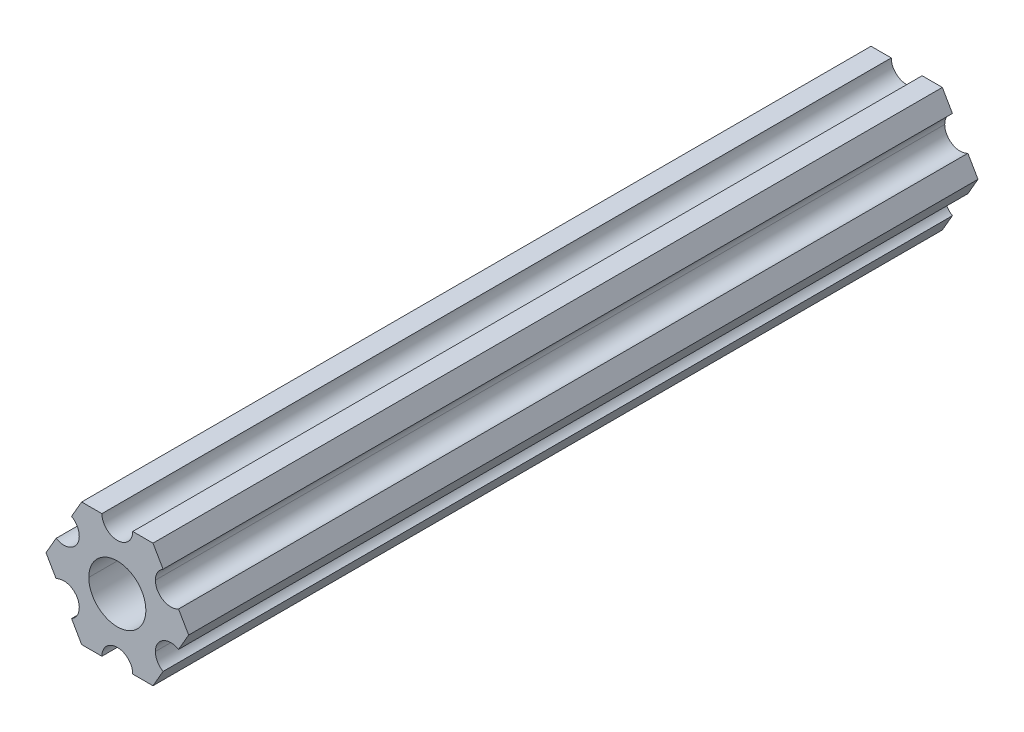
ISO-10303-21;
HEADER;
FILE_DESCRIPTION(('STEP AP214'),'2;1');
FILE_NAME('part.step','',(''),(''),'','','');
FILE_SCHEMA(('AUTOMOTIVE_DESIGN { 1 0 10303 214 1 1 1 1 }'));
ENDSEC;
DATA;
#1=APPLICATION_CONTEXT('core data for automotive mechanical design processes');
#2=APPLICATION_PROTOCOL_DEFINITION('international standard','automotive_design',2000,#1);
#3=PRODUCT_CONTEXT('',#1,'mechanical');
#4=PRODUCT('Part','Part','',(#3));
#5=PRODUCT_RELATED_PRODUCT_CATEGORY('part','',(#4));
#6=PRODUCT_DEFINITION_FORMATION('','',#4);
#7=PRODUCT_DEFINITION_CONTEXT('part definition',#1,'design');
#8=PRODUCT_DEFINITION('design','',#6,#7);
#9=PRODUCT_DEFINITION_SHAPE('','',#8);
#10=(LENGTH_UNIT() NAMED_UNIT(*) SI_UNIT(.MILLI.,.METRE.));
#11=(NAMED_UNIT(*) PLANE_ANGLE_UNIT() SI_UNIT($,.RADIAN.));
#12=(NAMED_UNIT(*) SI_UNIT($,.STERADIAN.) SOLID_ANGLE_UNIT());
#13=UNCERTAINTY_MEASURE_WITH_UNIT(LENGTH_MEASURE(1.E-05),#10,'distance_accuracy_value','');
#14=(GEOMETRIC_REPRESENTATION_CONTEXT(3) GLOBAL_UNCERTAINTY_ASSIGNED_CONTEXT((#13)) GLOBAL_UNIT_ASSIGNED_CONTEXT((#10,
#11,#12)) REPRESENTATION_CONTEXT('',''));
#15=CARTESIAN_POINT('',(0.,0.,0.));
#16=DIRECTION('',(0.,0.,1.));
#17=DIRECTION('',(1.,0.,0.));
#18=AXIS2_PLACEMENT_3D('',#15,#16,#17);
#19=CARTESIAN_POINT('',(0.,0.,304.8));
#20=DIRECTION('',(0.,0.,-1.));
#21=DIRECTION('',(-1.,0.,0.));
#22=AXIS2_PLACEMENT_3D('',#19,#20,#21);
#23=CYLINDRICAL_SURFACE('',#22,2.9337);
#24=CARTESIAN_POINT('',(0.,0.,81.153));
#25=DIRECTION('',(0.,0.,1.));
#26=DIRECTION('',(1.,0.,0.));
#27=AXIS2_PLACEMENT_3D('',#24,#25,#26);
#28=CIRCLE('',#27,2.9337);
#29=CARTESIAN_POINT('',(2.9337,0.,81.153));
#30=VERTEX_POINT('',#29);
#31=CARTESIAN_POINT('',(-2.9337,0.,81.153));
#32=VERTEX_POINT('',#31);
#33=EDGE_CURVE('E72',#30,#32,#28,.F.);
#34=ORIENTED_EDGE('',*,*,#33,.F.);
#35=DIRECTION('',(0.,0.,-1.));
#36=VECTOR('',#35,1.);
#37=CARTESIAN_POINT('',(2.9337,0.,304.8));
#38=LINE('',#37,#36);
#39=CARTESIAN_POINT('',(2.9337,0.,0.));
#40=VERTEX_POINT('',#39);
#41=EDGE_CURVE('E59',#30,#40,#38,.T.);
#42=ORIENTED_EDGE('',*,*,#41,.T.);
#43=CARTESIAN_POINT('',(0.,0.,0.));
#44=DIRECTION('',(0.,0.,1.));
#45=DIRECTION('',(1.,0.,0.));
#46=AXIS2_PLACEMENT_3D('',#43,#44,#45);
#47=CIRCLE('',#46,2.9337);
#48=CARTESIAN_POINT('',(-2.9337,0.,0.));
#49=VERTEX_POINT('',#48);
#50=EDGE_CURVE('E275',#49,#40,#47,.T.);
#51=ORIENTED_EDGE('',*,*,#50,.F.);
#52=DIRECTION('',(0.,0.,-1.));
#53=VECTOR('',#52,1.);
#54=CARTESIAN_POINT('',(-2.9337,0.,304.8));
#55=LINE('',#54,#53);
#56=EDGE_CURVE('E325',#32,#49,#55,.T.);
#57=ORIENTED_EDGE('',*,*,#56,.F.);
#58=EDGE_LOOP('',(#34,#42,#51,#57));
#59=FACE_BOUND('',#58,.T.);
#60=ADVANCED_FACE('F50',(#59),#23,.F.);
#61=CARTESIAN_POINT('',(5.49926150638082,-3.17499966684067,304.8));
#62=DIRECTION('',(0.,0.,-1.));
#63=DIRECTION('',(-1.,0.,0.));
#64=AXIS2_PLACEMENT_3D('',#61,#62,#63);
#65=CYLINDRICAL_SURFACE('',#64,1.5875);
#66=CARTESIAN_POINT('',(5.49926150638082,-3.17499966684067,81.153));
#67=DIRECTION('',(0.,0.,1.));
#68=DIRECTION('',(1.,0.,0.));
#69=AXIS2_PLACEMENT_3D('',#66,#67,#68);
#70=CIRCLE('',#69,1.5875);
#71=CARTESIAN_POINT('',(3.91176150638082,-3.17499966684067,81.153));
#72=VERTEX_POINT('',#71);
#73=CARTESIAN_POINT('',(6.29301142309097,-1.80018429024546,81.153));
#74=VERTEX_POINT('',#73);
#75=EDGE_CURVE('E225',#72,#74,#70,.F.);
#76=ORIENTED_EDGE('',*,*,#75,.F.);
#77=DIRECTION('',(0.,0.,-1.));
#78=VECTOR('',#77,1.);
#79=CARTESIAN_POINT('',(3.91176150638082,-3.17499966684067,304.8));
#80=LINE('',#79,#78);
#81=CARTESIAN_POINT('',(3.91176150638082,-3.17499966684067,0.));
#82=VERTEX_POINT('',#81);
#83=EDGE_CURVE('E264',#72,#82,#80,.T.);
#84=ORIENTED_EDGE('',*,*,#83,.T.);
#85=CARTESIAN_POINT('',(5.49926150638082,-3.17499966684067,0.));
#86=DIRECTION('',(0.,0.,-1.));
#87=DIRECTION('',(1.,0.,0.));
#88=AXIS2_PLACEMENT_3D('',#85,#86,#87);
#89=CIRCLE('',#88,1.5875);
#90=CARTESIAN_POINT('',(6.29301142309098,-1.80018429024546,0.));
#91=VERTEX_POINT('',#90);
#92=EDGE_CURVE('E267',#82,#91,#89,.T.);
#93=ORIENTED_EDGE('',*,*,#92,.T.);
#94=DIRECTION('',(0.,0.,-1.));
#95=VECTOR('',#94,1.);
#96=CARTESIAN_POINT('',(6.29301142309098,-1.80018429024546,304.8));
#97=LINE('',#96,#95);
#98=EDGE_CURVE('E251',#74,#91,#97,.T.);
#99=ORIENTED_EDGE('',*,*,#98,.F.);
#100=EDGE_LOOP('',(#76,#84,#93,#99));
#101=FACE_BOUND('',#100,.T.);
#102=ADVANCED_FACE('F359',(#101),#65,.F.);
#103=CARTESIAN_POINT('',(5.49926112168156,3.17500033315934,304.8));
#104=DIRECTION('',(0.,0.,-1.));
#105=DIRECTION('',(-1.,0.,0.));
#106=AXIS2_PLACEMENT_3D('',#103,#104,#105);
#107=CYLINDRICAL_SURFACE('',#106,1.5875);
#108=CARTESIAN_POINT('',(5.49926112168156,3.17500033315934,81.153));
#109=DIRECTION('',(0.,0.,1.));
#110=DIRECTION('',(1.,0.,0.));
#111=AXIS2_PLACEMENT_3D('',#108,#109,#110);
#112=CIRCLE('',#111,1.5875);
#113=CARTESIAN_POINT('',(3.91176112168156,3.17500033315934,81.153));
#114=VERTEX_POINT('',#113);
#115=CARTESIAN_POINT('',(4.70551103839171,4.54981561357971,81.153));
#116=VERTEX_POINT('',#115);
#117=EDGE_CURVE('E374',#114,#116,#112,.F.);
#118=ORIENTED_EDGE('',*,*,#117,.F.);
#119=DIRECTION('',(0.,0.,-1.));
#120=VECTOR('',#119,1.);
#121=CARTESIAN_POINT('',(3.91176112168156,3.17500033315934,304.8));
#122=LINE('',#121,#120);
#123=CARTESIAN_POINT('',(3.91176112168156,3.17500033315934,0.));
#124=VERTEX_POINT('',#123);
#125=EDGE_CURVE('E316',#114,#124,#122,.T.);
#126=ORIENTED_EDGE('',*,*,#125,.T.);
#127=CARTESIAN_POINT('',(5.49926112168156,3.17500033315934,0.));
#128=DIRECTION('',(0.,0.,-1.));
#129=DIRECTION('',(1.,0.,0.));
#130=AXIS2_PLACEMENT_3D('',#127,#128,#129);
#131=CIRCLE('',#130,1.5875);
#132=CARTESIAN_POINT('',(4.70551103839172,4.54981561357972,0.));
#133=VERTEX_POINT('',#132);
#134=EDGE_CURVE('E312',#124,#133,#131,.T.);
#135=ORIENTED_EDGE('',*,*,#134,.T.);
#136=DIRECTION('',(0.,0.,-1.));
#137=VECTOR('',#136,1.);
#138=CARTESIAN_POINT('',(4.70551103839172,4.54981561357972,304.8));
#139=LINE('',#138,#137);
#140=EDGE_CURVE('E263',#116,#133,#139,.T.);
#141=ORIENTED_EDGE('',*,*,#140,.F.);
#142=EDGE_LOOP('',(#118,#126,#135,#141));
#143=FACE_BOUND('',#142,.T.);
#144=ADVANCED_FACE('F691',(#143),#107,.F.);
#145=CARTESIAN_POINT('',(6.29301142309098,-1.80018429024546,304.8));
#146=DIRECTION('',(-0.866025434075723,0.499999947533953,0.));
#147=DIRECTION('',(0.,0.,1.));
#148=AXIS2_PLACEMENT_3D('',#145,#146,#147);
#149=PLANE('',#148);
#150=DIRECTION('',(0.499999947533948,0.866025434075726,0.));
#151=VECTOR('',#150,1.);
#152=CARTESIAN_POINT('',(3.66617459405349,-6.34999977789373,81.153));
#153=LINE('',#152,#151);
#154=CARTESIAN_POINT('',(7.33234841870826,4.44212561699631E-07,81.153));
#155=VERTEX_POINT('',#154);
#156=EDGE_CURVE('E219',#74,#155,#153,.T.);
#157=ORIENTED_EDGE('',*,*,#156,.F.);
#158=ORIENTED_EDGE('',*,*,#98,.T.);
#159=DIRECTION('',(0.499999947533953,0.866025434075723,0.));
#160=VECTOR('',#159,1.);
#161=CARTESIAN_POINT('',(6.29301142309098,-1.80018429024546,0.));
#162=LINE('',#161,#160);
#163=CARTESIAN_POINT('',(7.33234841870827,4.44212519169686E-07,0.));
#164=VERTEX_POINT('',#163);
#165=EDGE_CURVE('E244',#91,#164,#162,.T.);
#166=ORIENTED_EDGE('',*,*,#165,.T.);
#167=DIRECTION('',(0.,0.,-1.));
#168=VECTOR('',#167,1.);
#169=CARTESIAN_POINT('',(7.33234841870827,4.44212519169686E-07,304.8));
#170=LINE('',#169,#168);
#171=EDGE_CURVE('E234',#155,#164,#170,.T.);
#172=ORIENTED_EDGE('',*,*,#171,.F.);
#173=EDGE_LOOP('',(#157,#158,#166,#172));
#174=FACE_BOUND('',#173,.T.);
#175=ADVANCED_FACE('F242',(#174),#149,.F.);
#176=CARTESIAN_POINT('',(7.33234841870827,4.44212519169686E-07,304.8));
#177=DIRECTION('',(-0.866025373493145,-0.500000052466057,0.));
#178=DIRECTION('',(-0.500000052466057,0.866025373493145,0.));
#179=AXIS2_PLACEMENT_3D('',#176,#177,#178);
#180=PLANE('',#179);
#181=DIRECTION('',(-0.50000005246605,0.866025373493149,0.));
#182=VECTOR('',#181,1.);
#183=CARTESIAN_POINT('',(7.33234841870826,4.44212561699631E-07,81.153));
#184=LINE('',#183,#182);
#185=CARTESIAN_POINT('',(6.29301120497142,1.80018505273897,81.153));
#186=VERTEX_POINT('',#185);
#187=EDGE_CURVE('E222',#155,#186,#184,.T.);
#188=ORIENTED_EDGE('',*,*,#187,.F.);
#189=ORIENTED_EDGE('',*,*,#171,.T.);
#190=DIRECTION('',(-0.500000052466056,0.866025373493145,0.));
#191=VECTOR('',#190,1.);
#192=CARTESIAN_POINT('',(7.33234841870827,4.44212519169686E-07,0.));
#193=LINE('',#192,#191);
#194=CARTESIAN_POINT('',(6.29301120497139,1.80018505273894,0.));
#195=VERTEX_POINT('',#194);
#196=EDGE_CURVE('E246',#164,#195,#193,.T.);
#197=ORIENTED_EDGE('',*,*,#196,.T.);
#198=DIRECTION('',(0.,0.,-1.));
#199=VECTOR('',#198,1.);
#200=CARTESIAN_POINT('',(6.29301120497139,1.80018505273894,304.8));
#201=LINE('',#200,#199);
#202=EDGE_CURVE('E236',#186,#195,#201,.T.);
#203=ORIENTED_EDGE('',*,*,#202,.F.);
#204=EDGE_LOOP('',(#188,#189,#197,#203));
#205=FACE_BOUND('',#204,.T.);
#206=ADVANCED_FACE('F52',(#205),#180,.F.);
#207=CARTESIAN_POINT('',(5.49926112168156,3.17500033315934,304.8));
#208=DIRECTION('',(0.,0.,-1.));
#209=DIRECTION('',(-1.,0.,0.));
#210=AXIS2_PLACEMENT_3D('',#207,#208,#209);
#211=CYLINDRICAL_SURFACE('',#210,1.5875);
#212=CARTESIAN_POINT('',(5.49926112168156,3.17500033315934,81.153));
#213=DIRECTION('',(0.,0.,1.));
#214=DIRECTION('',(1.,0.,0.));
#215=AXIS2_PLACEMENT_3D('',#212,#213,#214);
#216=CIRCLE('',#215,1.5875);
#217=EDGE_CURVE('E371',#186,#114,#216,.F.);
#218=ORIENTED_EDGE('',*,*,#217,.F.);
#219=ORIENTED_EDGE('',*,*,#202,.T.);
#220=CARTESIAN_POINT('',(5.49926112168156,3.17500033315934,0.));
#221=DIRECTION('',(0.,0.,-1.));
#222=DIRECTION('',(1.,0.,0.));
#223=AXIS2_PLACEMENT_3D('',#220,#221,#222);
#224=CIRCLE('',#223,1.5875);
#225=EDGE_CURVE('E253',#195,#124,#224,.T.);
#226=ORIENTED_EDGE('',*,*,#225,.T.);
#227=ORIENTED_EDGE('',*,*,#125,.F.);
#228=EDGE_LOOP('',(#218,#219,#226,#227));
#229=FACE_BOUND('',#228,.T.);
#230=ADVANCED_FACE('F370',(#229),#211,.F.);
#231=CARTESIAN_POINT('',(4.70551103839172,4.54981561357972,304.8));
#232=DIRECTION('',(-0.866025373493151,-0.500000052466046,0.));
#233=DIRECTION('',(-0.500000052466046,0.866025373493151,0.));
#234=AXIS2_PLACEMENT_3D('',#231,#232,#233);
#235=PLANE('',#234);
#236=CARTESIAN_POINT('',(3.66617382465477,6.3500002221063,81.153));
#237=VERTEX_POINT('',#236);
#238=EDGE_CURVE('E239',#116,#237,#184,.T.);
#239=ORIENTED_EDGE('',*,*,#238,.F.);
#240=ORIENTED_EDGE('',*,*,#140,.T.);
#241=DIRECTION('',(-0.500000052466046,0.866025373493151,0.));
#242=VECTOR('',#241,1.);
#243=CARTESIAN_POINT('',(4.70551103839172,4.54981561357972,0.));
#244=LINE('',#243,#242);
#245=CARTESIAN_POINT('',(3.66617382465481,6.35000022210627,0.));
#246=VERTEX_POINT('',#245);
#247=EDGE_CURVE('E259',#133,#246,#244,.T.);
#248=ORIENTED_EDGE('',*,*,#247,.T.);
#249=DIRECTION('',(0.,0.,-1.));
#250=VECTOR('',#249,1.);
#251=CARTESIAN_POINT('',(3.66617382465481,6.35000022210627,304.8));
#252=LINE('',#251,#250);
#253=EDGE_CURVE('E335',#237,#246,#252,.T.);
#254=ORIENTED_EDGE('',*,*,#253,.F.);
#255=EDGE_LOOP('',(#239,#240,#248,#254));
#256=FACE_BOUND('',#255,.T.);
#257=ADVANCED_FACE('F639',(#256),#235,.F.);
#258=CARTESIAN_POINT('',(3.66617382465481,6.35000022210627,304.8));
#259=DIRECTION('',(6.05825850611185E-08,-1.,0.));
#260=DIRECTION('',(0.,0.,-1.));
#261=AXIS2_PLACEMENT_3D('',#258,#259,#260);
#262=PLANE('',#261);
#263=DIRECTION('',(-0.999999999999998,-6.05825767497455E-08,0.));
#264=VECTOR('',#263,1.);
#265=CARTESIAN_POINT('',(3.66617382465477,6.3500002221063,81.153));
#266=LINE('',#265,#264);
#267=CARTESIAN_POINT('',(1.58749961530074,6.35000009617486,81.153));
#268=VERTEX_POINT('',#267);
#269=EDGE_CURVE('E1010',#237,#268,#266,.T.);
#270=ORIENTED_EDGE('',*,*,#269,.F.);
#271=ORIENTED_EDGE('',*,*,#253,.T.);
#272=DIRECTION('',(-1.,-6.05825850611185E-08,0.));
#273=VECTOR('',#272,1.);
#274=CARTESIAN_POINT('',(3.66617382465481,6.35000022210627,0.));
#275=LINE('',#274,#273);
#276=CARTESIAN_POINT('',(1.58749961530074,6.35000009617482,0.));
#277=VERTEX_POINT('',#276);
#278=EDGE_CURVE('E338',#246,#277,#275,.T.);
#279=ORIENTED_EDGE('',*,*,#278,.T.);
#280=DIRECTION('',(0.,0.,-1.));
#281=VECTOR('',#280,1.);
#282=CARTESIAN_POINT('',(1.58749961530074,6.35000009617482,304.8));
#283=LINE('',#282,#281);
#284=EDGE_CURVE('E288',#268,#277,#283,.T.);
#285=ORIENTED_EDGE('',*,*,#284,.F.);
#286=EDGE_LOOP('',(#270,#271,#279,#285));
#287=FACE_BOUND('',#286,.T.);
#288=ADVANCED_FACE('F625',(#287),#262,.F.);
#289=CARTESIAN_POINT('',(-3.84699260060323E-07,6.35,304.8));
#290=DIRECTION('',(0.,0.,-1.));
#291=DIRECTION('',(-1.,0.,0.));
#292=AXIS2_PLACEMENT_3D('',#289,#290,#291);
#293=CYLINDRICAL_SURFACE('',#292,1.5875);
#294=CARTESIAN_POINT('',(-3.84699260060323E-07,6.35,81.153));
#295=DIRECTION('',(0.,0.,1.));
#296=DIRECTION('',(1.,0.,0.));
#297=AXIS2_PLACEMENT_3D('',#294,#295,#296);
#298=CIRCLE('',#297,1.5875);
#299=CARTESIAN_POINT('',(-1.58750038469926,6.34999990382518,81.153));
#300=VERTEX_POINT('',#299);
#301=EDGE_CURVE('E375',#268,#300,#298,.F.);
#302=ORIENTED_EDGE('',*,*,#301,.F.);
#303=ORIENTED_EDGE('',*,*,#284,.T.);
#304=CARTESIAN_POINT('',(-3.84699260060323E-07,6.35,0.));
#305=DIRECTION('',(0.,0.,-1.));
#306=DIRECTION('',(1.,0.,0.));
#307=AXIS2_PLACEMENT_3D('',#304,#305,#306);
#308=CIRCLE('',#307,1.5875);
#309=CARTESIAN_POINT('',(-1.58750038469926,6.34999990382519,0.));
#310=VERTEX_POINT('',#309);
#311=EDGE_CURVE('E339',#277,#310,#308,.T.);
#312=ORIENTED_EDGE('',*,*,#311,.T.);
#313=DIRECTION('',(0.,0.,-1.));
#314=VECTOR('',#313,1.);
#315=CARTESIAN_POINT('',(-1.58750038469926,6.34999990382519,304.8));
#316=LINE('',#315,#314);
#317=EDGE_CURVE('E280',#300,#310,#316,.T.);
#318=ORIENTED_EDGE('',*,*,#317,.F.);
#319=EDGE_LOOP('',(#302,#303,#312,#318));
#320=FACE_BOUND('',#319,.T.);
#321=ADVANCED_FACE('F611',(#320),#293,.F.);
#322=CARTESIAN_POINT('',(-1.58750038469926,6.34999990382518,304.8));
#323=DIRECTION('',(6.05825963273174E-08,-1.,0.));
#324=DIRECTION('',(0.,0.,-1.));
#325=AXIS2_PLACEMENT_3D('',#322,#323,#324);
#326=PLANE('',#325);
#327=CARTESIAN_POINT('',(-3.66617459405349,6.34999977789374,81.153));
#328=VERTEX_POINT('',#327);
#329=EDGE_CURVE('E238',#300,#328,#266,.T.);
#330=ORIENTED_EDGE('',*,*,#329,.F.);
#331=ORIENTED_EDGE('',*,*,#317,.T.);
#332=DIRECTION('',(-1.,-6.05825963273174E-08,0.));
#333=VECTOR('',#332,1.);
#334=CARTESIAN_POINT('',(-1.58750038469926,6.34999990382518,0.));
#335=LINE('',#334,#333);
#336=CARTESIAN_POINT('',(-3.66617459405349,6.3499997778937,0.));
#337=VERTEX_POINT('',#336);
#338=EDGE_CURVE('E283',#310,#337,#335,.T.);
#339=ORIENTED_EDGE('',*,*,#338,.T.);
#340=DIRECTION('',(0.,0.,-1.));
#341=VECTOR('',#340,1.);
#342=CARTESIAN_POINT('',(-3.66617459405349,6.3499997778937,304.8));
#343=LINE('',#342,#341);
#344=EDGE_CURVE('E289',#328,#337,#343,.T.);
#345=ORIENTED_EDGE('',*,*,#344,.F.);
#346=EDGE_LOOP('',(#330,#331,#339,#345));
#347=FACE_BOUND('',#346,.T.);
#348=ADVANCED_FACE('F597',(#347),#326,.F.);
#349=CARTESIAN_POINT('',(-3.66617459405349,6.3499997778937,304.8));
#350=DIRECTION('',(0.866025434075729,-0.499999947533942,0.));
#351=DIRECTION('',(0.,0.,-1.));
#352=AXIS2_PLACEMENT_3D('',#349,#350,#351);
#353=PLANE('',#352);
#354=DIRECTION('',(-0.499999947533949,-0.866025434075725,0.));
#355=VECTOR('',#354,1.);
#356=CARTESIAN_POINT('',(-3.66617459405349,6.34999977789374,81.153));
#357=LINE('',#356,#355);
#358=CARTESIAN_POINT('',(-4.70551158967069,4.54981504343589,81.153));
#359=VERTEX_POINT('',#358);
#360=EDGE_CURVE('E1004',#328,#359,#357,.T.);
#361=ORIENTED_EDGE('',*,*,#360,.F.);
#362=ORIENTED_EDGE('',*,*,#344,.T.);
#363=DIRECTION('',(-0.499999947533943,-0.866025434075729,0.));
#364=VECTOR('',#363,1.);
#365=CARTESIAN_POINT('',(-3.66617459405349,6.3499997778937,0.));
#366=LINE('',#365,#364);
#367=CARTESIAN_POINT('',(-4.70551158967065,4.54981504343587,0.));
#368=VERTEX_POINT('',#367);
#369=EDGE_CURVE('E284',#337,#368,#366,.T.);
#370=ORIENTED_EDGE('',*,*,#369,.T.);
#371=DIRECTION('',(0.,0.,-1.));
#372=VECTOR('',#371,1.);
#373=CARTESIAN_POINT('',(-4.70551158967065,4.54981504343587,304.8));
#374=LINE('',#373,#372);
#375=EDGE_CURVE('E311',#359,#368,#374,.T.);
#376=ORIENTED_EDGE('',*,*,#375,.F.);
#377=EDGE_LOOP('',(#361,#362,#370,#376));
#378=FACE_BOUND('',#377,.T.);
#379=ADVANCED_FACE('F583',(#378),#353,.F.);
#380=CARTESIAN_POINT('',(-5.49926150638082,3.17499966684067,304.8));
#381=DIRECTION('',(0.,0.,-1.));
#382=DIRECTION('',(-1.,0.,0.));
#383=AXIS2_PLACEMENT_3D('',#380,#381,#382);
#384=CYLINDRICAL_SURFACE('',#383,1.5875);
#385=CARTESIAN_POINT('',(-5.49926150638082,3.17499966684067,81.153));
#386=DIRECTION('',(0.,0.,1.));
#387=DIRECTION('',(1.,0.,0.));
#388=AXIS2_PLACEMENT_3D('',#385,#386,#387);
#389=CIRCLE('',#388,1.5875);
#390=CARTESIAN_POINT('',(-6.29301142309097,1.80018429024546,81.153));
#391=VERTEX_POINT('',#390);
#392=EDGE_CURVE('E380',#359,#391,#389,.F.);
#393=ORIENTED_EDGE('',*,*,#392,.F.);
#394=ORIENTED_EDGE('',*,*,#375,.T.);
#395=CARTESIAN_POINT('',(-5.49926150638082,3.17499966684067,0.));
#396=DIRECTION('',(0.,0.,-1.));
#397=DIRECTION('',(1.,0.,0.));
#398=AXIS2_PLACEMENT_3D('',#395,#396,#397);
#399=CIRCLE('',#398,1.5875);
#400=CARTESIAN_POINT('',(-6.29301142309098,1.80018429024547,0.));
#401=VERTEX_POINT('',#400);
#402=EDGE_CURVE('E292',#368,#401,#399,.T.);
#403=ORIENTED_EDGE('',*,*,#402,.T.);
#404=DIRECTION('',(0.,0.,-1.));
#405=VECTOR('',#404,1.);
#406=CARTESIAN_POINT('',(-6.29301142309098,1.80018429024547,304.8));
#407=LINE('',#406,#405);
#408=EDGE_CURVE('E305',#391,#401,#407,.T.);
#409=ORIENTED_EDGE('',*,*,#408,.F.);
#410=EDGE_LOOP('',(#393,#394,#403,#409));
#411=FACE_BOUND('',#410,.T.);
#412=ADVANCED_FACE('F569',(#411),#384,.F.);
#413=CARTESIAN_POINT('',(-6.29301142309098,1.80018429024547,304.8));
#414=DIRECTION('',(0.866025434075724,-0.499999947533952,0.));
#415=DIRECTION('',(0.,0.,-1.));
#416=AXIS2_PLACEMENT_3D('',#413,#414,#415);
#417=PLANE('',#416);
#418=CARTESIAN_POINT('',(-7.33234841870827,-4.44212560975334E-07,81.153));
#419=VERTEX_POINT('',#418);
#420=EDGE_CURVE('E1001',#391,#419,#357,.T.);
#421=ORIENTED_EDGE('',*,*,#420,.F.);
#422=ORIENTED_EDGE('',*,*,#408,.T.);
#423=DIRECTION('',(-0.499999947533951,-0.866025434075724,0.));
#424=VECTOR('',#423,1.);
#425=CARTESIAN_POINT('',(-6.29301142309098,1.80018429024547,0.));
#426=LINE('',#425,#424);
#427=CARTESIAN_POINT('',(-7.33234841870827,-4.44212523790841E-07,0.));
#428=VERTEX_POINT('',#427);
#429=EDGE_CURVE('E307',#401,#428,#426,.T.);
#430=ORIENTED_EDGE('',*,*,#429,.T.);
#431=DIRECTION('',(0.,0.,-1.));
#432=VECTOR('',#431,1.);
#433=CARTESIAN_POINT('',(-7.33234841870827,-4.44212523790841E-07,304.8));
#434=LINE('',#433,#432);
#435=EDGE_CURVE('E306',#419,#428,#434,.T.);
#436=ORIENTED_EDGE('',*,*,#435,.F.);
#437=EDGE_LOOP('',(#421,#422,#430,#436));
#438=FACE_BOUND('',#437,.T.);
#439=ADVANCED_FACE('F555',(#438),#417,.F.);
#440=CARTESIAN_POINT('',(-7.33234841870827,-4.44212523790841E-07,304.8));
#441=DIRECTION('',(0.866025373493151,0.500000052466045,0.));
#442=DIRECTION('',(0.,0.,-1.));
#443=AXIS2_PLACEMENT_3D('',#440,#441,#442);
#444=PLANE('',#443);
#445=DIRECTION('',(0.50000005246605,-0.866025373493149,0.));
#446=VECTOR('',#445,1.);
#447=CARTESIAN_POINT('',(-7.33234841870827,-4.44212560975334E-07,81.153));
#448=LINE('',#447,#446);
#449=CARTESIAN_POINT('',(-6.29301120497142,-1.80018505273897,81.153));
#450=VERTEX_POINT('',#449);
#451=EDGE_CURVE('E1033',#419,#450,#448,.T.);
#452=ORIENTED_EDGE('',*,*,#451,.F.);
#453=ORIENTED_EDGE('',*,*,#435,.T.);
#454=DIRECTION('',(0.500000052466045,-0.866025373493151,0.));
#455=VECTOR('',#454,1.);
#456=CARTESIAN_POINT('',(-7.33234841870827,-4.44212523790841E-07,0.));
#457=LINE('',#456,#455);
#458=CARTESIAN_POINT('',(-6.29301120497141,-1.80018505273897,0.));
#459=VERTEX_POINT('',#458);
#460=EDGE_CURVE('E301',#428,#459,#457,.T.);
#461=ORIENTED_EDGE('',*,*,#460,.T.);
#462=DIRECTION('',(0.,0.,-1.));
#463=VECTOR('',#462,1.);
#464=CARTESIAN_POINT('',(-6.29301120497141,-1.80018505273897,304.8));
#465=LINE('',#464,#463);
#466=EDGE_CURVE('E299',#450,#459,#465,.T.);
#467=ORIENTED_EDGE('',*,*,#466,.F.);
#468=EDGE_LOOP('',(#452,#453,#461,#467));
#469=FACE_BOUND('',#468,.T.);
#470=ADVANCED_FACE('F541',(#469),#444,.F.);
#471=CARTESIAN_POINT('',(-5.49926112168156,-3.17500033315934,304.8));
#472=DIRECTION('',(0.,0.,-1.));
#473=DIRECTION('',(-1.,0.,0.));
#474=AXIS2_PLACEMENT_3D('',#471,#472,#473);
#475=CYLINDRICAL_SURFACE('',#474,1.5875);
#476=CARTESIAN_POINT('',(-5.49926112168156,-3.17500033315934,81.153));
#477=DIRECTION('',(0.,0.,1.));
#478=DIRECTION('',(1.,0.,0.));
#479=AXIS2_PLACEMENT_3D('',#476,#477,#478);
#480=CIRCLE('',#479,1.5875);
#481=CARTESIAN_POINT('',(-4.70551103839171,-4.54981561357972,81.153));
#482=VERTEX_POINT('',#481);
#483=EDGE_CURVE('E996',#450,#482,#480,.F.);
#484=ORIENTED_EDGE('',*,*,#483,.F.);
#485=ORIENTED_EDGE('',*,*,#466,.T.);
#486=CARTESIAN_POINT('',(-5.49926112168156,-3.17500033315934,0.));
#487=DIRECTION('',(0.,0.,-1.));
#488=DIRECTION('',(1.,0.,0.));
#489=AXIS2_PLACEMENT_3D('',#486,#487,#488);
#490=CIRCLE('',#489,1.5875);
#491=CARTESIAN_POINT('',(-4.70551103839172,-4.54981561357972,0.));
#492=VERTEX_POINT('',#491);
#493=EDGE_CURVE('E332',#459,#492,#490,.T.);
#494=ORIENTED_EDGE('',*,*,#493,.T.);
#495=DIRECTION('',(0.,0.,-1.));
#496=VECTOR('',#495,1.);
#497=CARTESIAN_POINT('',(-4.70551103839172,-4.54981561357972,304.8));
#498=LINE('',#497,#496);
#499=EDGE_CURVE('E300',#482,#492,#498,.T.);
#500=ORIENTED_EDGE('',*,*,#499,.F.);
#501=EDGE_LOOP('',(#484,#485,#494,#500));
#502=FACE_BOUND('',#501,.T.);
#503=ADVANCED_FACE('F527',(#502),#475,.F.);
#504=CARTESIAN_POINT('',(-4.70551103839172,-4.54981561357972,304.8));
#505=DIRECTION('',(0.866025373493152,0.500000052466045,0.));
#506=DIRECTION('',(0.,0.,-1.));
#507=AXIS2_PLACEMENT_3D('',#504,#505,#506);
#508=PLANE('',#507);
#509=CARTESIAN_POINT('',(-3.66617382465477,-6.35000022210629,81.153));
#510=VERTEX_POINT('',#509);
#511=EDGE_CURVE('E1032',#482,#510,#448,.T.);
#512=ORIENTED_EDGE('',*,*,#511,.F.);
#513=ORIENTED_EDGE('',*,*,#499,.T.);
#514=DIRECTION('',(0.500000052466045,-0.866025373493152,0.));
#515=VECTOR('',#514,1.);
#516=CARTESIAN_POINT('',(-4.70551103839172,-4.54981561357972,0.));
#517=LINE('',#516,#515);
#518=CARTESIAN_POINT('',(-3.66617382465481,-6.35000022210628,0.));
#519=VERTEX_POINT('',#518);
#520=EDGE_CURVE('E295',#492,#519,#517,.T.);
#521=ORIENTED_EDGE('',*,*,#520,.T.);
#522=DIRECTION('',(0.,0.,-1.));
#523=VECTOR('',#522,1.);
#524=CARTESIAN_POINT('',(-3.66617382465481,-6.35000022210628,304.8));
#525=LINE('',#524,#523);
#526=EDGE_CURVE('E276',#510,#519,#525,.T.);
#527=ORIENTED_EDGE('',*,*,#526,.F.);
#528=EDGE_LOOP('',(#512,#513,#521,#527));
#529=FACE_BOUND('',#528,.T.);
#530=ADVANCED_FACE('F515',(#529),#508,.F.);
#531=CARTESIAN_POINT('',(-3.66617382465481,-6.35000022210628,304.8));
#532=DIRECTION('',(-6.05825854783851E-08,1.,0.));
#533=DIRECTION('',(0.,0.,1.));
#534=AXIS2_PLACEMENT_3D('',#531,#532,#533);
#535=PLANE('',#534);
#536=DIRECTION('',(0.999999999999998,6.0582576631453E-08,0.));
#537=VECTOR('',#536,1.);
#538=CARTESIAN_POINT('',(-3.66617382465477,-6.35000022210629,81.153));
#539=LINE('',#538,#537);
#540=CARTESIAN_POINT('',(-1.58749961530074,-6.35000009617486,81.153));
#541=VERTEX_POINT('',#540);
#542=EDGE_CURVE('E444',#510,#541,#539,.T.);
#543=ORIENTED_EDGE('',*,*,#542,.F.);
#544=ORIENTED_EDGE('',*,*,#526,.T.);
#545=DIRECTION('',(1.,6.05825854783851E-08,0.));
#546=VECTOR('',#545,1.);
#547=CARTESIAN_POINT('',(-3.66617382465481,-6.35000022210628,0.));
#548=LINE('',#547,#546);
#549=CARTESIAN_POINT('',(-1.58749961530073,-6.35000009617482,0.));
#550=VERTEX_POINT('',#549);
#551=EDGE_CURVE('E257',#519,#550,#548,.T.);
#552=ORIENTED_EDGE('',*,*,#551,.T.);
#553=DIRECTION('',(0.,0.,-1.));
#554=VECTOR('',#553,1.);
#555=CARTESIAN_POINT('',(-1.58749961530073,-6.35000009617482,304.8));
#556=LINE('',#555,#554);
#557=EDGE_CURVE('E329',#541,#550,#556,.T.);
#558=ORIENTED_EDGE('',*,*,#557,.F.);
#559=EDGE_LOOP('',(#543,#544,#552,#558));
#560=FACE_BOUND('',#559,.T.);
#561=ADVANCED_FACE('F443',(#560),#535,.F.);
#562=CARTESIAN_POINT('',(3.8469926204343E-07,-6.35,304.8));
#563=DIRECTION('',(0.,0.,-1.));
#564=DIRECTION('',(-1.,0.,0.));
#565=AXIS2_PLACEMENT_3D('',#562,#563,#564);
#566=CYLINDRICAL_SURFACE('',#565,1.5875);
#567=CARTESIAN_POINT('',(3.8469926204343E-07,-6.35,81.153));
#568=DIRECTION('',(0.,0.,1.));
#569=DIRECTION('',(1.,0.,0.));
#570=AXIS2_PLACEMENT_3D('',#567,#568,#569);
#571=CIRCLE('',#570,1.5875);
#572=CARTESIAN_POINT('',(1.58750038469926,-6.34999990382518,81.153));
#573=VERTEX_POINT('',#572);
#574=EDGE_CURVE('E440',#541,#573,#571,.F.);
#575=ORIENTED_EDGE('',*,*,#574,.F.);
#576=ORIENTED_EDGE('',*,*,#557,.T.);
#577=CARTESIAN_POINT('',(3.8469926204343E-07,-6.35,0.));
#578=DIRECTION('',(0.,0.,-1.));
#579=DIRECTION('',(1.,0.,0.));
#580=AXIS2_PLACEMENT_3D('',#577,#578,#579);
#581=CIRCLE('',#580,1.5875);
#582=CARTESIAN_POINT('',(1.58750038469926,-6.34999990382518,0.));
#583=VERTEX_POINT('',#582);
#584=EDGE_CURVE('E279',#550,#583,#581,.T.);
#585=ORIENTED_EDGE('',*,*,#584,.T.);
#586=DIRECTION('',(0.,0.,-1.));
#587=VECTOR('',#586,1.);
#588=CARTESIAN_POINT('',(1.58750038469926,-6.34999990382518,304.8));
#589=LINE('',#588,#587);
#590=EDGE_CURVE('E390',#573,#583,#589,.T.);
#591=ORIENTED_EDGE('',*,*,#590,.F.);
#592=EDGE_LOOP('',(#575,#576,#585,#591));
#593=FACE_BOUND('',#592,.T.);
#594=ADVANCED_FACE('F438',(#593),#566,.F.);
#595=CARTESIAN_POINT('',(1.58750038469926,-6.34999990382518,304.8));
#596=DIRECTION('',(-6.05825721258438E-08,1.,0.));
#597=DIRECTION('',(0.,0.,1.));
#598=AXIS2_PLACEMENT_3D('',#595,#596,#597);
#599=PLANE('',#598);
#600=CARTESIAN_POINT('',(3.66617459405349,-6.34999977789373,81.153));
#601=VERTEX_POINT('',#600);
#602=EDGE_CURVE('E431',#573,#601,#539,.T.);
#603=ORIENTED_EDGE('',*,*,#602,.F.);
#604=ORIENTED_EDGE('',*,*,#590,.T.);
#605=DIRECTION('',(1.,6.05825721258438E-08,0.));
#606=VECTOR('',#605,1.);
#607=CARTESIAN_POINT('',(1.58750038469926,-6.34999990382518,0.));
#608=LINE('',#607,#606);
#609=CARTESIAN_POINT('',(3.66617459405346,-6.34999977789375,0.));
#610=VERTEX_POINT('',#609);
#611=EDGE_CURVE('E386',#583,#610,#608,.T.);
#612=ORIENTED_EDGE('',*,*,#611,.T.);
#613=DIRECTION('',(0.,0.,-1.));
#614=VECTOR('',#613,1.);
#615=CARTESIAN_POINT('',(3.66617459405346,-6.34999977789375,304.8));
#616=LINE('',#615,#614);
#617=EDGE_CURVE('E344',#601,#610,#616,.T.);
#618=ORIENTED_EDGE('',*,*,#617,.F.);
#619=EDGE_LOOP('',(#603,#604,#612,#618));
#620=FACE_BOUND('',#619,.T.);
#621=ADVANCED_FACE('F430',(#620),#599,.F.);
#622=CARTESIAN_POINT('',(3.66617459405346,-6.34999977789375,304.8));
#623=DIRECTION('',(-0.86602543407573,0.499999947533941,0.));
#624=DIRECTION('',(0.,0.,1.));
#625=AXIS2_PLACEMENT_3D('',#622,#623,#624);
#626=PLANE('',#625);
#627=CARTESIAN_POINT('',(4.70551158967065,-4.54981504343587,81.153));
#628=VERTEX_POINT('',#627);
#629=EDGE_CURVE('E66',#601,#628,#153,.T.);
#630=ORIENTED_EDGE('',*,*,#629,.F.);
#631=ORIENTED_EDGE('',*,*,#617,.T.);
#632=DIRECTION('',(0.499999947533941,0.86602543407573,0.));
#633=VECTOR('',#632,1.);
#634=CARTESIAN_POINT('',(3.66617459405346,-6.34999977789375,0.));
#635=LINE('',#634,#633);
#636=CARTESIAN_POINT('',(4.70551158967065,-4.54981504343587,0.));
#637=VERTEX_POINT('',#636);
#638=EDGE_CURVE('E347',#610,#637,#635,.T.);
#639=ORIENTED_EDGE('',*,*,#638,.T.);
#640=DIRECTION('',(0.,0.,-1.));
#641=VECTOR('',#640,1.);
#642=CARTESIAN_POINT('',(4.70551158967065,-4.54981504343587,304.8));
#643=LINE('',#642,#641);
#644=EDGE_CURVE('E324',#628,#637,#643,.T.);
#645=ORIENTED_EDGE('',*,*,#644,.F.);
#646=EDGE_LOOP('',(#630,#631,#639,#645));
#647=FACE_BOUND('',#646,.T.);
#648=ADVANCED_FACE('F426',(#647),#626,.F.);
#649=CARTESIAN_POINT('',(5.49926150638082,-3.17499966684067,304.8));
#650=DIRECTION('',(0.,0.,-1.));
#651=DIRECTION('',(-1.,0.,0.));
#652=AXIS2_PLACEMENT_3D('',#649,#650,#651);
#653=CYLINDRICAL_SURFACE('',#652,1.5875);
#654=CARTESIAN_POINT('',(5.49926150638082,-3.17499966684067,81.153));
#655=DIRECTION('',(0.,0.,1.));
#656=DIRECTION('',(1.,0.,0.));
#657=AXIS2_PLACEMENT_3D('',#654,#655,#656);
#658=CIRCLE('',#657,1.5875);
#659=EDGE_CURVE('E422',#628,#72,#658,.F.);
#660=ORIENTED_EDGE('',*,*,#659,.F.);
#661=ORIENTED_EDGE('',*,*,#644,.T.);
#662=CARTESIAN_POINT('',(5.49926150638082,-3.17499966684067,0.));
#663=DIRECTION('',(0.,0.,-1.));
#664=DIRECTION('',(1.,0.,0.));
#665=AXIS2_PLACEMENT_3D('',#662,#663,#664);
#666=CIRCLE('',#665,1.5875);
#667=EDGE_CURVE('E320',#637,#82,#666,.T.);
#668=ORIENTED_EDGE('',*,*,#667,.T.);
#669=ORIENTED_EDGE('',*,*,#83,.F.);
#670=EDGE_LOOP('',(#660,#661,#668,#669));
#671=FACE_BOUND('',#670,.T.);
#672=ADVANCED_FACE('F421',(#671),#653,.F.);
#673=CARTESIAN_POINT('',(0.,0.,304.8));
#674=DIRECTION('',(0.,0.,-1.));
#675=DIRECTION('',(-1.,0.,0.));
#676=AXIS2_PLACEMENT_3D('',#673,#674,#675);
#677=CYLINDRICAL_SURFACE('',#676,2.9337);
#678=CARTESIAN_POINT('',(0.,0.,81.153));
#679=DIRECTION('',(0.,0.,1.));
#680=DIRECTION('',(1.,0.,0.));
#681=AXIS2_PLACEMENT_3D('',#678,#679,#680);
#682=CIRCLE('',#681,2.9337);
#683=EDGE_CURVE('E11',#32,#30,#682,.F.);
#684=ORIENTED_EDGE('',*,*,#683,.F.);
#685=ORIENTED_EDGE('',*,*,#56,.T.);
#686=CARTESIAN_POINT('',(0.,0.,0.));
#687=DIRECTION('',(0.,0.,1.));
#688=DIRECTION('',(1.,0.,0.));
#689=AXIS2_PLACEMENT_3D('',#686,#687,#688);
#690=CIRCLE('',#689,2.9337);
#691=EDGE_CURVE('E271',#40,#49,#690,.T.);
#692=ORIENTED_EDGE('',*,*,#691,.F.);
#693=ORIENTED_EDGE('',*,*,#41,.F.);
#694=EDGE_LOOP('',(#684,#685,#692,#693));
#695=FACE_BOUND('',#694,.T.);
#696=ADVANCED_FACE('F730',(#695),#677,.F.);
#697=CARTESIAN_POINT('',(5.49926112168156,3.17500033315934,0.));
#698=DIRECTION('',(0.,0.,1.));
#699=DIRECTION('',(1.,0.,0.));
#700=AXIS2_PLACEMENT_3D('',#697,#698,#699);
#701=PLANE('',#700);
#702=ORIENTED_EDGE('',*,*,#165,.F.);
#703=ORIENTED_EDGE('',*,*,#92,.F.);
#704=ORIENTED_EDGE('',*,*,#667,.F.);
#705=ORIENTED_EDGE('',*,*,#638,.F.);
#706=ORIENTED_EDGE('',*,*,#611,.F.);
#707=ORIENTED_EDGE('',*,*,#584,.F.);
#708=ORIENTED_EDGE('',*,*,#551,.F.);
#709=ORIENTED_EDGE('',*,*,#520,.F.);
#710=ORIENTED_EDGE('',*,*,#493,.F.);
#711=ORIENTED_EDGE('',*,*,#460,.F.);
#712=ORIENTED_EDGE('',*,*,#429,.F.);
#713=ORIENTED_EDGE('',*,*,#402,.F.);
#714=ORIENTED_EDGE('',*,*,#369,.F.);
#715=ORIENTED_EDGE('',*,*,#338,.F.);
#716=ORIENTED_EDGE('',*,*,#311,.F.);
#717=ORIENTED_EDGE('',*,*,#278,.F.);
#718=ORIENTED_EDGE('',*,*,#247,.F.);
#719=ORIENTED_EDGE('',*,*,#134,.F.);
#720=ORIENTED_EDGE('',*,*,#225,.F.);
#721=ORIENTED_EDGE('',*,*,#196,.F.);
#722=EDGE_LOOP('',(#702,#703,#704,#705,#706,#707,#708,#709,#710,#711,#712,#713,#714,#715,#716,
#717,#718,#719,#720,#721));
#723=FACE_BOUND('',#722,.T.);
#724=ORIENTED_EDGE('',*,*,#50,.T.);
#725=ORIENTED_EDGE('',*,*,#691,.T.);
#726=EDGE_LOOP('',(#724,#725));
#727=FACE_BOUND('',#726,.T.);
#728=ADVANCED_FACE('F363',(#723,#727),#701,.F.);
#729=CARTESIAN_POINT('',(0.,0.,81.153));
#730=DIRECTION('',(0.,0.,1.));
#731=DIRECTION('',(1.,0.,0.));
#732=AXIS2_PLACEMENT_3D('',#729,#730,#731);
#733=PLANE('',#732);
#734=ORIENTED_EDGE('',*,*,#33,.T.);
#735=ORIENTED_EDGE('',*,*,#683,.T.);
#736=EDGE_LOOP('',(#734,#735));
#737=FACE_BOUND('',#736,.T.);
#738=ORIENTED_EDGE('',*,*,#117,.T.);
#739=ORIENTED_EDGE('',*,*,#238,.T.);
#740=ORIENTED_EDGE('',*,*,#269,.T.);
#741=ORIENTED_EDGE('',*,*,#301,.T.);
#742=ORIENTED_EDGE('',*,*,#329,.T.);
#743=ORIENTED_EDGE('',*,*,#360,.T.);
#744=ORIENTED_EDGE('',*,*,#392,.T.);
#745=ORIENTED_EDGE('',*,*,#420,.T.);
#746=ORIENTED_EDGE('',*,*,#451,.T.);
#747=ORIENTED_EDGE('',*,*,#483,.T.);
#748=ORIENTED_EDGE('',*,*,#511,.T.);
#749=ORIENTED_EDGE('',*,*,#542,.T.);
#750=ORIENTED_EDGE('',*,*,#574,.T.);
#751=ORIENTED_EDGE('',*,*,#602,.T.);
#752=ORIENTED_EDGE('',*,*,#629,.T.);
#753=ORIENTED_EDGE('',*,*,#659,.T.);
#754=ORIENTED_EDGE('',*,*,#75,.T.);
#755=ORIENTED_EDGE('',*,*,#156,.T.);
#756=ORIENTED_EDGE('',*,*,#187,.T.);
#757=ORIENTED_EDGE('',*,*,#217,.T.);
#758=EDGE_LOOP('',(#738,#739,#740,#741,#742,#743,#744,#745,#746,#747,#748,#749,#750,#751,#752,
#753,#754,#755,#756,#757));
#759=FACE_BOUND('',#758,.T.);
#760=ADVANCED_FACE('F221',(#737,#759),#733,.T.);
#761=CLOSED_SHELL('',(#60,#102,#144,#175,#206,#230,#257,#288,#321,#348,#379,#412,#439,#470,#503,
#530,#561,#594,#621,#648,#672,#696,#728,#760));
#762=MANIFOLD_SOLID_BREP('B2',#761);
#763=ADVANCED_BREP_SHAPE_REPRESENTATION('',(#18,#762),#14);
#764=SHAPE_DEFINITION_REPRESENTATION(#9,#763);
ENDSEC;
END-ISO-10303-21;
